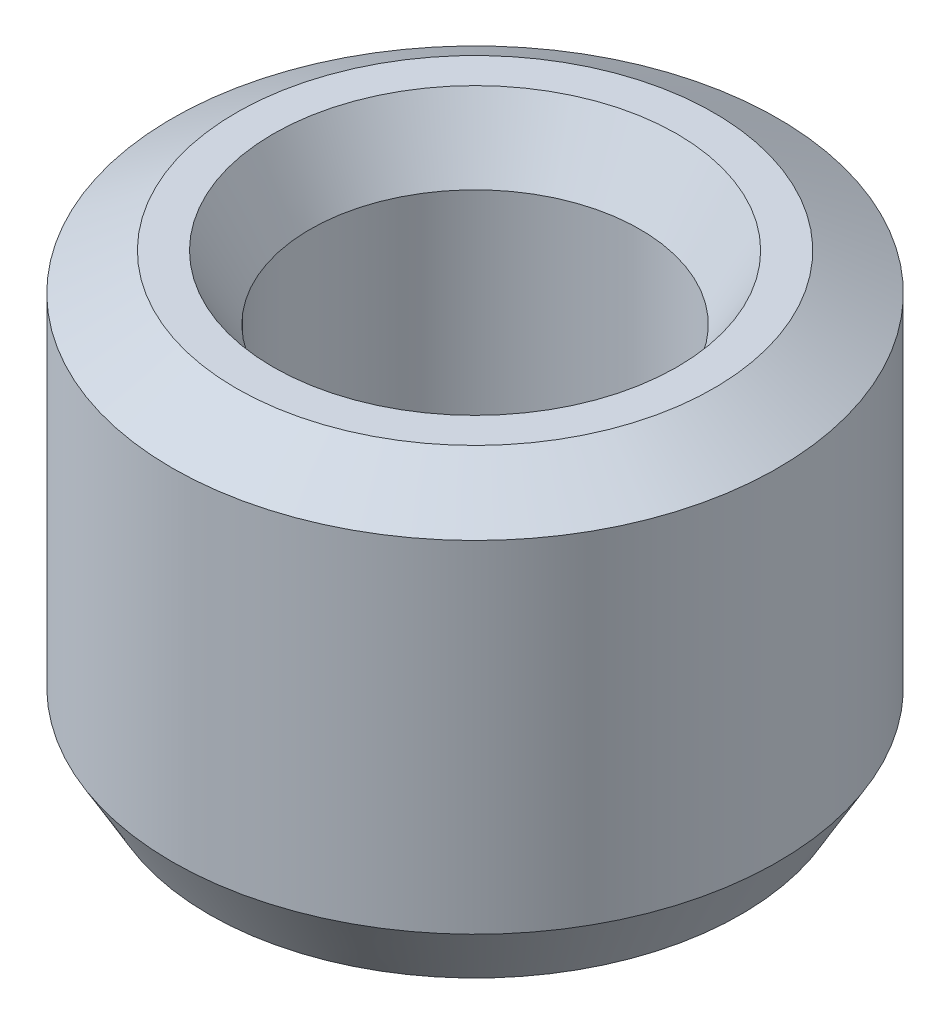
ISO-10303-21;
HEADER;
FILE_DESCRIPTION(('STEP AP214'),'2;1');
FILE_NAME('part.step','',(''),(''),'','','');
FILE_SCHEMA(('AUTOMOTIVE_DESIGN { 1 0 10303 214 1 1 1 1 }'));
ENDSEC;
DATA;
#1=APPLICATION_CONTEXT('core data for automotive mechanical design processes');
#2=APPLICATION_PROTOCOL_DEFINITION('international standard','automotive_design',2000,#1);
#3=PRODUCT_CONTEXT('',#1,'mechanical');
#4=PRODUCT('Part','Part','',(#3));
#5=PRODUCT_RELATED_PRODUCT_CATEGORY('part','',(#4));
#6=PRODUCT_DEFINITION_FORMATION('','',#4);
#7=PRODUCT_DEFINITION_CONTEXT('part definition',#1,'design');
#8=PRODUCT_DEFINITION('design','',#6,#7);
#9=PRODUCT_DEFINITION_SHAPE('','',#8);
#10=(LENGTH_UNIT() NAMED_UNIT(*) SI_UNIT(.MILLI.,.METRE.));
#11=(NAMED_UNIT(*) PLANE_ANGLE_UNIT() SI_UNIT($,.RADIAN.));
#12=(NAMED_UNIT(*) SI_UNIT($,.STERADIAN.) SOLID_ANGLE_UNIT());
#13=UNCERTAINTY_MEASURE_WITH_UNIT(LENGTH_MEASURE(1.E-05),#10,'distance_accuracy_value','');
#14=(GEOMETRIC_REPRESENTATION_CONTEXT(3) GLOBAL_UNCERTAINTY_ASSIGNED_CONTEXT((#13)) GLOBAL_UNIT_ASSIGNED_CONTEXT((#10,
#11,#12)) REPRESENTATION_CONTEXT('',''));
#15=CARTESIAN_POINT('',(0.,0.,0.));
#16=DIRECTION('',(0.,0.,1.));
#17=DIRECTION('',(1.,0.,0.));
#18=AXIS2_PLACEMENT_3D('',#15,#16,#17);
#19=CARTESIAN_POINT('',(0.,47.4426097655758,0.));
#20=DIRECTION('',(0.,-1.,0.));
#21=DIRECTION('',(0.,0.,-1.));
#22=AXIS2_PLACEMENT_3D('',#19,#20,#21);
#23=CYLINDRICAL_SURFACE('',#22,32.5);
#24=CARTESIAN_POINT('',(0.,6.87654142914187,0.));
#25=DIRECTION('',(0.,1.,0.));
#26=DIRECTION('',(0.,0.,1.));
#27=AXIS2_PLACEMENT_3D('',#24,#25,#26);
#28=CIRCLE('',#27,32.5);
#29=CARTESIAN_POINT('',(0.,6.87654142914187,32.5));
#30=VERTEX_POINT('',#29);
#31=EDGE_CURVE('E10',#30,#30,#28,.T.);
#32=ORIENTED_EDGE('',*,*,#31,.T.);
#33=EDGE_LOOP('',(#32));
#34=FACE_BOUND('',#33,.T.);
#35=CARTESIAN_POINT('',(0.,43.472436720367,0.));
#36=DIRECTION('',(0.,1.,0.));
#37=DIRECTION('',(0.,0.,1.));
#38=AXIS2_PLACEMENT_3D('',#35,#36,#37);
#39=CIRCLE('',#38,32.5);
#40=CARTESIAN_POINT('',(0.,43.472436720367,32.5));
#41=VERTEX_POINT('',#40);
#42=EDGE_CURVE('E50',#41,#41,#39,.F.);
#43=ORIENTED_EDGE('',*,*,#42,.T.);
#44=EDGE_LOOP('',(#43));
#45=FACE_BOUND('',#44,.T.);
#46=ADVANCED_FACE('F39',(#34,#45),#23,.T.);
#47=CARTESIAN_POINT('',(0.,47.4426097655758,0.));
#48=DIRECTION('',(0.,1.,0.));
#49=DIRECTION('',(0.,0.,1.));
#50=AXIS2_PLACEMENT_3D('',#47,#48,#49);
#51=PLANE('',#50);
#52=CARTESIAN_POINT('',(0.,47.4426097655758,0.));
#53=DIRECTION('',(0.,1.,0.));
#54=DIRECTION('',(0.,0.,1.));
#55=AXIS2_PLACEMENT_3D('',#52,#53,#54);
#56=CIRCLE('',#55,21.6705378988694);
#57=CARTESIAN_POINT('',(0.,47.4426097655758,21.6705378988694));
#58=VERTEX_POINT('',#57);
#59=EDGE_CURVE('E58',#58,#58,#56,.F.);
#60=ORIENTED_EDGE('',*,*,#59,.T.);
#61=EDGE_LOOP('',(#60));
#62=FACE_BOUND('',#61,.T.);
#63=CARTESIAN_POINT('',(0.,47.4426097655758,0.));
#64=DIRECTION('',(0.,1.,0.));
#65=DIRECTION('',(0.,0.,1.));
#66=AXIS2_PLACEMENT_3D('',#63,#64,#65);
#67=CIRCLE('',#66,25.6234585708581);
#68=CARTESIAN_POINT('',(0.,47.4426097655758,25.6234585708581));
#69=VERTEX_POINT('',#68);
#70=EDGE_CURVE('E61',#69,#69,#67,.T.);
#71=ORIENTED_EDGE('',*,*,#70,.T.);
#72=EDGE_LOOP('',(#71));
#73=FACE_BOUND('',#72,.T.);
#74=ADVANCED_FACE('F88',(#62,#73),#51,.T.);
#75=CARTESIAN_POINT('',(0.,0.,0.));
#76=DIRECTION('',(0.,1.,0.));
#77=DIRECTION('',(0.,0.,1.));
#78=AXIS2_PLACEMENT_3D('',#75,#76,#77);
#79=PLANE('',#78);
#80=CARTESIAN_POINT('',(0.,0.,0.));
#81=DIRECTION('',(0.,1.,0.));
#82=DIRECTION('',(0.,0.,1.));
#83=AXIS2_PLACEMENT_3D('',#80,#81,#82);
#84=CIRCLE('',#83,24.5769062828026);
#85=CARTESIAN_POINT('',(0.,0.,24.5769062828026));
#86=VERTEX_POINT('',#85);
#87=EDGE_CURVE('E51',#86,#86,#84,.T.);
#88=ORIENTED_EDGE('',*,*,#87,.T.);
#89=EDGE_LOOP('',(#88));
#90=FACE_BOUND('',#89,.T.);
#91=CARTESIAN_POINT('',(0.,0.,0.));
#92=DIRECTION('',(0.,1.,0.));
#93=DIRECTION('',(0.,0.,1.));
#94=AXIS2_PLACEMENT_3D('',#91,#92,#93);
#95=CIRCLE('',#94,28.5298269547913);
#96=CARTESIAN_POINT('',(0.,0.,28.5298269547913));
#97=VERTEX_POINT('',#96);
#98=EDGE_CURVE('E54',#97,#97,#95,.F.);
#99=ORIENTED_EDGE('',*,*,#98,.T.);
#100=EDGE_LOOP('',(#99));
#101=FACE_BOUND('',#100,.T.);
#102=ADVANCED_FACE('F83',(#90,#101),#79,.F.);
#103=CARTESIAN_POINT('',(0.,47.4426097655758,0.));
#104=DIRECTION('',(0.,-1.,0.));
#105=DIRECTION('',(0.,0.,-1.));
#106=AXIS2_PLACEMENT_3D('',#103,#104,#105);
#107=CYLINDRICAL_SURFACE('',#106,17.7003648536607);
#108=CARTESIAN_POINT('',(0.,40.5660683364338,0.));
#109=DIRECTION('',(0.,1.,0.));
#110=DIRECTION('',(0.,0.,1.));
#111=AXIS2_PLACEMENT_3D('',#108,#109,#110);
#112=CIRCLE('',#111,17.7003648536607);
#113=CARTESIAN_POINT('',(0.,40.5660683364338,17.7003648536607));
#114=VERTEX_POINT('',#113);
#115=EDGE_CURVE('E67',#114,#114,#112,.T.);
#116=ORIENTED_EDGE('',*,*,#115,.T.);
#117=EDGE_LOOP('',(#116));
#118=FACE_BOUND('',#117,.T.);
#119=CARTESIAN_POINT('',(0.,3.97017304520873,0.));
#120=DIRECTION('',(0.,1.,0.));
#121=DIRECTION('',(0.,0.,1.));
#122=AXIS2_PLACEMENT_3D('',#119,#120,#121);
#123=CIRCLE('',#122,17.7003648536607);
#124=CARTESIAN_POINT('',(0.,3.97017304520873,17.7003648536607));
#125=VERTEX_POINT('',#124);
#126=EDGE_CURVE('E69',#125,#125,#123,.F.);
#127=ORIENTED_EDGE('',*,*,#126,.T.);
#128=EDGE_LOOP('',(#127));
#129=FACE_BOUND('',#128,.T.);
#130=ADVANCED_FACE('F71',(#118,#129),#107,.F.);
#131=CARTESIAN_POINT('',(0.,40.5660683364338,0.));
#132=DIRECTION('',(0.,1.,0.));
#133=DIRECTION('',(0.,0.,1.));
#134=AXIS2_PLACEMENT_3D('',#131,#132,#133);
#135=CONICAL_SURFACE('',#134,17.7003648536607,0.523598775598302);
#136=ORIENTED_EDGE('',*,*,#59,.F.);
#137=EDGE_LOOP('',(#136));
#138=FACE_BOUND('',#137,.T.);
#139=ORIENTED_EDGE('',*,*,#115,.F.);
#140=EDGE_LOOP('',(#139));
#141=FACE_BOUND('',#140,.T.);
#142=ADVANCED_FACE('F77',(#138,#141),#135,.F.);
#143=CARTESIAN_POINT('',(0.,0.,0.));
#144=DIRECTION('',(0.,-1.,0.));
#145=DIRECTION('',(0.,0.,-1.));
#146=AXIS2_PLACEMENT_3D('',#143,#144,#145);
#147=CONICAL_SURFACE('',#146,24.5769062828026,1.04719755119659);
#148=ORIENTED_EDGE('',*,*,#126,.F.);
#149=EDGE_LOOP('',(#148));
#150=FACE_BOUND('',#149,.T.);
#151=ORIENTED_EDGE('',*,*,#87,.F.);
#152=EDGE_LOOP('',(#151));
#153=FACE_BOUND('',#152,.T.);
#154=ADVANCED_FACE('F73',(#150,#153),#147,.F.);
#155=CARTESIAN_POINT('',(0.,6.87654142914187,0.));
#156=DIRECTION('',(0.,1.,0.));
#157=DIRECTION('',(0.,0.,1.));
#158=AXIS2_PLACEMENT_3D('',#155,#156,#157);
#159=CONICAL_SURFACE('',#158,32.5,0.523598775598302);
#160=ORIENTED_EDGE('',*,*,#98,.F.);
#161=EDGE_LOOP('',(#160));
#162=FACE_BOUND('',#161,.T.);
#163=ORIENTED_EDGE('',*,*,#31,.F.);
#164=EDGE_LOOP('',(#163));
#165=FACE_BOUND('',#164,.T.);
#166=ADVANCED_FACE('F76',(#162,#165),#159,.T.);
#167=CARTESIAN_POINT('',(0.,47.4426097655758,0.));
#168=DIRECTION('',(0.,-1.,0.));
#169=DIRECTION('',(0.,0.,-1.));
#170=AXIS2_PLACEMENT_3D('',#167,#168,#169);
#171=CONICAL_SURFACE('',#170,25.6234585708581,1.04719755119659);
#172=ORIENTED_EDGE('',*,*,#42,.F.);
#173=EDGE_LOOP('',(#172));
#174=FACE_BOUND('',#173,.T.);
#175=ORIENTED_EDGE('',*,*,#70,.F.);
#176=EDGE_LOOP('',(#175));
#177=FACE_BOUND('',#176,.T.);
#178=ADVANCED_FACE('F45',(#174,#177),#171,.T.);
#179=CLOSED_SHELL('',(#46,#74,#102,#130,#142,#154,#166,#178));
#180=MANIFOLD_SOLID_BREP('B2',#179);
#181=ADVANCED_BREP_SHAPE_REPRESENTATION('',(#18,#180),#14);
#182=SHAPE_DEFINITION_REPRESENTATION(#9,#181);
ENDSEC;
END-ISO-10303-21;
